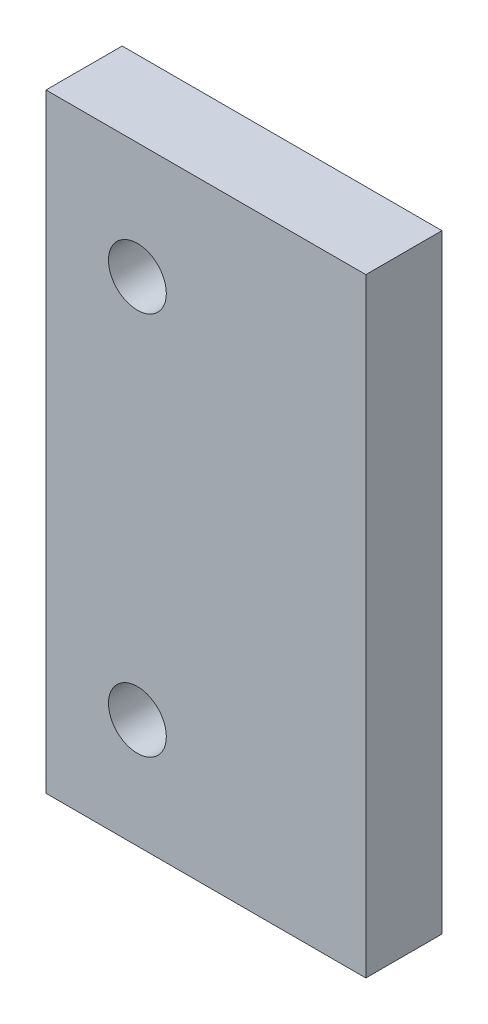
ISO-10303-21;
HEADER;
FILE_DESCRIPTION(('STEP AP214'),'2;1');
FILE_NAME('part.step','',(''),(''),'','','');
FILE_SCHEMA(('AUTOMOTIVE_DESIGN { 1 0 10303 214 1 1 1 1 }'));
ENDSEC;
DATA;
#1=APPLICATION_CONTEXT('core data for automotive mechanical design processes');
#2=APPLICATION_PROTOCOL_DEFINITION('international standard','automotive_design',2000,#1);
#3=PRODUCT_CONTEXT('',#1,'mechanical');
#4=PRODUCT('Part','Part','',(#3));
#5=PRODUCT_RELATED_PRODUCT_CATEGORY('part','',(#4));
#6=PRODUCT_DEFINITION_FORMATION('','',#4);
#7=PRODUCT_DEFINITION_CONTEXT('part definition',#1,'design');
#8=PRODUCT_DEFINITION('design','',#6,#7);
#9=PRODUCT_DEFINITION_SHAPE('','',#8);
#10=(LENGTH_UNIT() NAMED_UNIT(*) SI_UNIT(.MILLI.,.METRE.));
#11=(NAMED_UNIT(*) PLANE_ANGLE_UNIT() SI_UNIT($,.RADIAN.));
#12=(NAMED_UNIT(*) SI_UNIT($,.STERADIAN.) SOLID_ANGLE_UNIT());
#13=UNCERTAINTY_MEASURE_WITH_UNIT(LENGTH_MEASURE(1.E-05),#10,'distance_accuracy_value','');
#14=(GEOMETRIC_REPRESENTATION_CONTEXT(3) GLOBAL_UNCERTAINTY_ASSIGNED_CONTEXT((#13)) GLOBAL_UNIT_ASSIGNED_CONTEXT((#10,
#11,#12)) REPRESENTATION_CONTEXT('',''));
#15=CARTESIAN_POINT('',(0.,0.,0.));
#16=DIRECTION('',(0.,0.,1.));
#17=DIRECTION('',(1.,0.,0.));
#18=AXIS2_PLACEMENT_3D('',#15,#16,#17);
#19=CARTESIAN_POINT('',(10.5,0.,2.5));
#20=DIRECTION('',(0.,1.,0.));
#21=DIRECTION('',(-1.,0.,0.));
#22=AXIS2_PLACEMENT_3D('',#19,#20,#21);
#23=PLANE('',#22);
#24=DIRECTION('',(1.,0.,0.));
#25=VECTOR('',#24,1.);
#26=CARTESIAN_POINT('',(10.5,0.,0.));
#27=LINE('',#26,#25);
#28=CARTESIAN_POINT('',(0.,0.,0.));
#29=VERTEX_POINT('',#28);
#30=CARTESIAN_POINT('',(10.5,0.,0.));
#31=VERTEX_POINT('',#30);
#32=EDGE_CURVE('E96',#29,#31,#27,.T.);
#33=ORIENTED_EDGE('',*,*,#32,.T.);
#34=DIRECTION('',(0.,0.,-1.));
#35=VECTOR('',#34,1.);
#36=CARTESIAN_POINT('',(10.5,0.,2.5));
#37=LINE('',#36,#35);
#38=CARTESIAN_POINT('',(10.5,0.,2.5));
#39=VERTEX_POINT('',#38);
#40=EDGE_CURVE('E11',#39,#31,#37,.T.);
#41=ORIENTED_EDGE('',*,*,#40,.F.);
#42=DIRECTION('',(1.,0.,0.));
#43=VECTOR('',#42,1.);
#44=CARTESIAN_POINT('',(10.5,0.,2.5));
#45=LINE('',#44,#43);
#46=CARTESIAN_POINT('',(0.,0.,2.5));
#47=VERTEX_POINT('',#46);
#48=EDGE_CURVE('E84',#47,#39,#45,.T.);
#49=ORIENTED_EDGE('',*,*,#48,.F.);
#50=DIRECTION('',(0.,0.,-1.));
#51=VECTOR('',#50,1.);
#52=CARTESIAN_POINT('',(0.,0.,2.5));
#53=LINE('',#52,#51);
#54=EDGE_CURVE('E92',#47,#29,#53,.T.);
#55=ORIENTED_EDGE('',*,*,#54,.T.);
#56=EDGE_LOOP('',(#33,#41,#49,#55));
#57=FACE_BOUND('',#56,.T.);
#58=ADVANCED_FACE('F33',(#57),#23,.F.);
#59=CARTESIAN_POINT('',(10.5,20.,2.5));
#60=DIRECTION('',(-1.,0.,0.));
#61=DIRECTION('',(0.,-1.,0.));
#62=AXIS2_PLACEMENT_3D('',#59,#60,#61);
#63=PLANE('',#62);
#64=DIRECTION('',(0.,1.,0.));
#65=VECTOR('',#64,1.);
#66=CARTESIAN_POINT('',(10.5,20.,0.));
#67=LINE('',#66,#65);
#68=CARTESIAN_POINT('',(10.5,20.,0.));
#69=VERTEX_POINT('',#68);
#70=EDGE_CURVE('E88',#31,#69,#67,.T.);
#71=ORIENTED_EDGE('',*,*,#70,.T.);
#72=DIRECTION('',(0.,0.,-1.));
#73=VECTOR('',#72,1.);
#74=CARTESIAN_POINT('',(10.5,20.,2.5));
#75=LINE('',#74,#73);
#76=CARTESIAN_POINT('',(10.5,20.,2.5));
#77=VERTEX_POINT('',#76);
#78=EDGE_CURVE('E41',#77,#69,#75,.T.);
#79=ORIENTED_EDGE('',*,*,#78,.F.);
#80=DIRECTION('',(0.,1.,0.));
#81=VECTOR('',#80,1.);
#82=CARTESIAN_POINT('',(10.5,20.,2.5));
#83=LINE('',#82,#81);
#84=EDGE_CURVE('E79',#39,#77,#83,.T.);
#85=ORIENTED_EDGE('',*,*,#84,.F.);
#86=ORIENTED_EDGE('',*,*,#40,.T.);
#87=EDGE_LOOP('',(#71,#79,#85,#86));
#88=FACE_BOUND('',#87,.T.);
#89=ADVANCED_FACE('F87',(#88),#63,.F.);
#90=CARTESIAN_POINT('',(0.,20.,2.5));
#91=DIRECTION('',(0.,-1.,0.));
#92=DIRECTION('',(1.,0.,0.));
#93=AXIS2_PLACEMENT_3D('',#90,#91,#92);
#94=PLANE('',#93);
#95=DIRECTION('',(-1.,0.,0.));
#96=VECTOR('',#95,1.);
#97=CARTESIAN_POINT('',(0.,20.,0.));
#98=LINE('',#97,#96);
#99=CARTESIAN_POINT('',(0.,20.,0.));
#100=VERTEX_POINT('',#99);
#101=EDGE_CURVE('E66',#69,#100,#98,.T.);
#102=ORIENTED_EDGE('',*,*,#101,.T.);
#103=DIRECTION('',(0.,0.,-1.));
#104=VECTOR('',#103,1.);
#105=CARTESIAN_POINT('',(0.,20.,2.5));
#106=LINE('',#105,#104);
#107=CARTESIAN_POINT('',(0.,20.,2.5));
#108=VERTEX_POINT('',#107);
#109=EDGE_CURVE('E89',#108,#100,#106,.T.);
#110=ORIENTED_EDGE('',*,*,#109,.F.);
#111=DIRECTION('',(-1.,0.,0.));
#112=VECTOR('',#111,1.);
#113=CARTESIAN_POINT('',(0.,20.,2.5));
#114=LINE('',#113,#112);
#115=EDGE_CURVE('E82',#77,#108,#114,.T.);
#116=ORIENTED_EDGE('',*,*,#115,.F.);
#117=ORIENTED_EDGE('',*,*,#78,.T.);
#118=EDGE_LOOP('',(#102,#110,#116,#117));
#119=FACE_BOUND('',#118,.T.);
#120=ADVANCED_FACE('F90',(#119),#94,.F.);
#121=CARTESIAN_POINT('',(0.,0.,2.5));
#122=DIRECTION('',(1.,0.,0.));
#123=DIRECTION('',(0.,1.,0.));
#124=AXIS2_PLACEMENT_3D('',#121,#122,#123);
#125=PLANE('',#124);
#126=DIRECTION('',(0.,-1.,0.));
#127=VECTOR('',#126,1.);
#128=CARTESIAN_POINT('',(0.,0.,0.));
#129=LINE('',#128,#127);
#130=EDGE_CURVE('E72',#100,#29,#129,.T.);
#131=ORIENTED_EDGE('',*,*,#130,.T.);
#132=ORIENTED_EDGE('',*,*,#54,.F.);
#133=DIRECTION('',(0.,-1.,0.));
#134=VECTOR('',#133,1.);
#135=CARTESIAN_POINT('',(0.,0.,2.5));
#136=LINE('',#135,#134);
#137=EDGE_CURVE('E49',#108,#47,#136,.T.);
#138=ORIENTED_EDGE('',*,*,#137,.F.);
#139=ORIENTED_EDGE('',*,*,#109,.T.);
#140=EDGE_LOOP('',(#131,#132,#138,#139));
#141=FACE_BOUND('',#140,.T.);
#142=ADVANCED_FACE('F104',(#141),#125,.F.);
#143=CARTESIAN_POINT('',(0.,0.,2.5));
#144=DIRECTION('',(0.,0.,-1.));
#145=DIRECTION('',(-1.,0.,0.));
#146=AXIS2_PLACEMENT_3D('',#143,#144,#145);
#147=PLANE('',#146);
#148=CARTESIAN_POINT('',(2.99999999999999,16.1882803570095,2.5));
#149=DIRECTION('',(0.,0.,1.));
#150=DIRECTION('',(1.,0.,0.));
#151=AXIS2_PLACEMENT_3D('',#148,#149,#150);
#152=CIRCLE('',#151,0.95);
#153=CARTESIAN_POINT('',(3.95,16.1882803570095,2.5));
#154=VERTEX_POINT('',#153);
#155=EDGE_CURVE('E116',#154,#154,#152,.T.);
#156=ORIENTED_EDGE('',*,*,#155,.F.);
#157=EDGE_LOOP('',(#156));
#158=FACE_BOUND('',#157,.T.);
#159=CARTESIAN_POINT('',(2.99999999999999,3.58828035700945,2.5));
#160=DIRECTION('',(0.,0.,1.));
#161=DIRECTION('',(1.,0.,0.));
#162=AXIS2_PLACEMENT_3D('',#159,#160,#161);
#163=CIRCLE('',#162,0.95);
#164=CARTESIAN_POINT('',(3.95,3.58828035700945,2.5));
#165=VERTEX_POINT('',#164);
#166=EDGE_CURVE('E110',#165,#165,#163,.T.);
#167=ORIENTED_EDGE('',*,*,#166,.F.);
#168=EDGE_LOOP('',(#167));
#169=FACE_BOUND('',#168,.T.);
#170=ORIENTED_EDGE('',*,*,#48,.T.);
#171=ORIENTED_EDGE('',*,*,#84,.T.);
#172=ORIENTED_EDGE('',*,*,#115,.T.);
#173=ORIENTED_EDGE('',*,*,#137,.T.);
#174=EDGE_LOOP('',(#170,#171,#172,#173));
#175=FACE_BOUND('',#174,.T.);
#176=ADVANCED_FACE('F80',(#158,#169,#175),#147,.F.);
#177=CARTESIAN_POINT('',(0.,0.,0.));
#178=DIRECTION('',(0.,0.,-1.));
#179=DIRECTION('',(-1.,0.,0.));
#180=AXIS2_PLACEMENT_3D('',#177,#178,#179);
#181=PLANE('',#180);
#182=CARTESIAN_POINT('',(2.99999999999999,16.1882803570095,0.));
#183=DIRECTION('',(0.,0.,1.));
#184=DIRECTION('',(1.,0.,0.));
#185=AXIS2_PLACEMENT_3D('',#182,#183,#184);
#186=CIRCLE('',#185,0.95);
#187=CARTESIAN_POINT('',(3.95,16.1882803570095,0.));
#188=VERTEX_POINT('',#187);
#189=EDGE_CURVE('E99',#188,#188,#186,.T.);
#190=ORIENTED_EDGE('',*,*,#189,.T.);
#191=EDGE_LOOP('',(#190));
#192=FACE_BOUND('',#191,.T.);
#193=CARTESIAN_POINT('',(2.99999999999999,3.58828035700945,0.));
#194=DIRECTION('',(0.,0.,1.));
#195=DIRECTION('',(1.,0.,0.));
#196=AXIS2_PLACEMENT_3D('',#193,#194,#195);
#197=CIRCLE('',#196,0.95);
#198=CARTESIAN_POINT('',(3.95,3.58828035700945,0.));
#199=VERTEX_POINT('',#198);
#200=EDGE_CURVE('E113',#199,#199,#197,.T.);
#201=ORIENTED_EDGE('',*,*,#200,.T.);
#202=EDGE_LOOP('',(#201));
#203=FACE_BOUND('',#202,.T.);
#204=ORIENTED_EDGE('',*,*,#32,.F.);
#205=ORIENTED_EDGE('',*,*,#130,.F.);
#206=ORIENTED_EDGE('',*,*,#101,.F.);
#207=ORIENTED_EDGE('',*,*,#70,.F.);
#208=EDGE_LOOP('',(#204,#205,#206,#207));
#209=FACE_BOUND('',#208,.T.);
#210=ADVANCED_FACE('F107',(#192,#203,#209),#181,.T.);
#211=CARTESIAN_POINT('',(2.99999999999999,3.58828035700945,0.));
#212=DIRECTION('',(0.,0.,1.));
#213=DIRECTION('',(1.,0.,0.));
#214=AXIS2_PLACEMENT_3D('',#211,#212,#213);
#215=CYLINDRICAL_SURFACE('',#214,0.95);
#216=ORIENTED_EDGE('',*,*,#200,.F.);
#217=EDGE_LOOP('',(#216));
#218=FACE_BOUND('',#217,.T.);
#219=ORIENTED_EDGE('',*,*,#166,.T.);
#220=EDGE_LOOP('',(#219));
#221=FACE_BOUND('',#220,.T.);
#222=ADVANCED_FACE('F127',(#218,#221),#215,.F.);
#223=CARTESIAN_POINT('',(2.99999999999999,16.1882803570095,0.));
#224=DIRECTION('',(0.,0.,1.));
#225=DIRECTION('',(1.,0.,0.));
#226=AXIS2_PLACEMENT_3D('',#223,#224,#225);
#227=CYLINDRICAL_SURFACE('',#226,0.95);
#228=ORIENTED_EDGE('',*,*,#189,.F.);
#229=EDGE_LOOP('',(#228));
#230=FACE_BOUND('',#229,.T.);
#231=ORIENTED_EDGE('',*,*,#155,.T.);
#232=EDGE_LOOP('',(#231));
#233=FACE_BOUND('',#232,.T.);
#234=ADVANCED_FACE('F124',(#230,#233),#227,.F.);
#235=CLOSED_SHELL('',(#58,#89,#120,#142,#176,#210,#222,#234));
#236=MANIFOLD_SOLID_BREP('B2',#235);
#237=ADVANCED_BREP_SHAPE_REPRESENTATION('',(#18,#236),#14);
#238=SHAPE_DEFINITION_REPRESENTATION(#9,#237);
ENDSEC;
END-ISO-10303-21;
